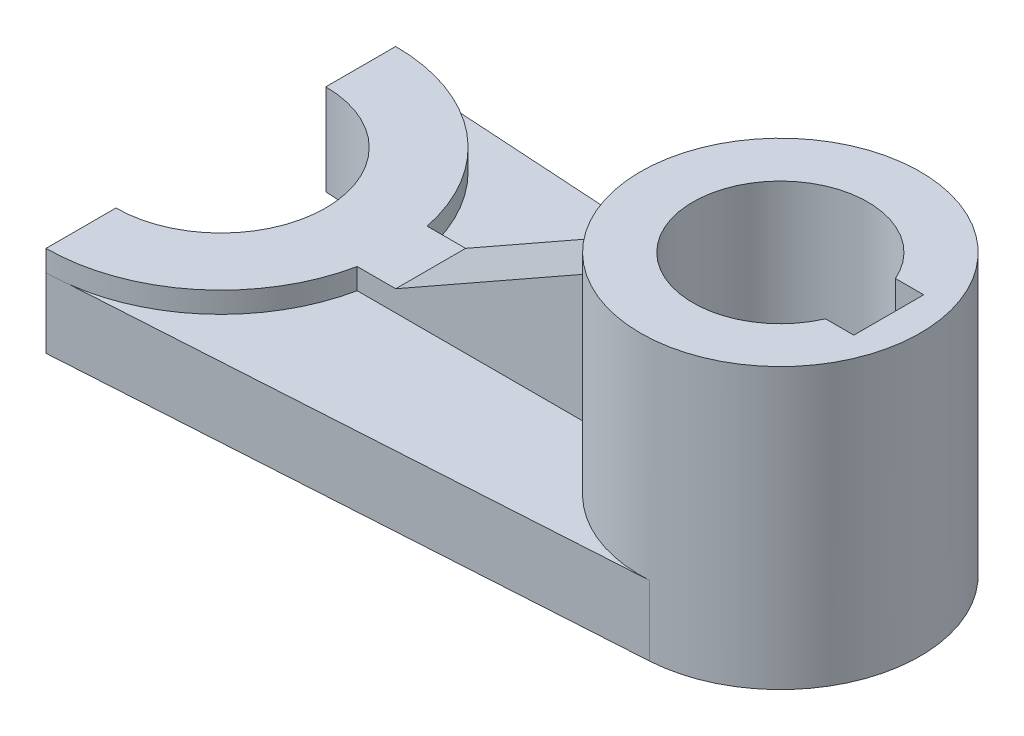
ISO-10303-21;
HEADER;
FILE_DESCRIPTION(('STEP AP214'),'2;1');
FILE_NAME('part.step','',(''),(''),'','','');
FILE_SCHEMA(('AUTOMOTIVE_DESIGN { 1 0 10303 214 1 1 1 1 }'));
ENDSEC;
DATA;
#1=APPLICATION_CONTEXT('core data for automotive mechanical design processes');
#2=APPLICATION_PROTOCOL_DEFINITION('international standard','automotive_design',2000,#1);
#3=PRODUCT_CONTEXT('',#1,'mechanical');
#4=PRODUCT('Part','Part','',(#3));
#5=PRODUCT_RELATED_PRODUCT_CATEGORY('part','',(#4));
#6=PRODUCT_DEFINITION_FORMATION('','',#4);
#7=PRODUCT_DEFINITION_CONTEXT('part definition',#1,'design');
#8=PRODUCT_DEFINITION('design','',#6,#7);
#9=PRODUCT_DEFINITION_SHAPE('','',#8);
#10=(LENGTH_UNIT() NAMED_UNIT(*) SI_UNIT(.MILLI.,.METRE.));
#11=(NAMED_UNIT(*) PLANE_ANGLE_UNIT() SI_UNIT($,.RADIAN.));
#12=(NAMED_UNIT(*) SI_UNIT($,.STERADIAN.) SOLID_ANGLE_UNIT());
#13=UNCERTAINTY_MEASURE_WITH_UNIT(LENGTH_MEASURE(1.E-05),#10,'distance_accuracy_value','');
#14=(GEOMETRIC_REPRESENTATION_CONTEXT(3) GLOBAL_UNCERTAINTY_ASSIGNED_CONTEXT((#13)) GLOBAL_UNIT_ASSIGNED_CONTEXT((#10,
#11,#12)) REPRESENTATION_CONTEXT('',''));
#15=CARTESIAN_POINT('',(0.,0.,0.));
#16=DIRECTION('',(0.,0.,1.));
#17=DIRECTION('',(1.,0.,0.));
#18=AXIS2_PLACEMENT_3D('',#15,#16,#17);
#19=CARTESIAN_POINT('',(-1.23801444701057,10.,0.));
#20=DIRECTION('',(0.,-1.,0.));
#21=DIRECTION('',(0.,0.,-1.));
#22=AXIS2_PLACEMENT_3D('',#19,#20,#21);
#23=PLANE('',#22);
#24=DIRECTION('',(-1.,0.,0.));
#25=VECTOR('',#24,1.);
#26=CARTESIAN_POINT('',(-1.23801444701057,10.,-5.));
#27=LINE('',#26,#25);
#28=CARTESIAN_POINT('',(-20.6029311780477,10.,-5.));
#29=VERTEX_POINT('',#28);
#30=CARTESIAN_POINT('',(-56.7431170191788,10.,-5.));
#31=VERTEX_POINT('',#30);
#32=EDGE_CURVE('E201',#29,#31,#27,.T.);
#33=ORIENTED_EDGE('',*,*,#32,.F.);
#34=CARTESIAN_POINT('',(-1.23801444701057,10.,0.));
#35=DIRECTION('',(0.,-1.,0.));
#36=DIRECTION('',(0.,0.,-1.));
#37=AXIS2_PLACEMENT_3D('',#34,#35,#36);
#38=CIRCLE('',#37,20.);
#39=CARTESIAN_POINT('',(0.,10.,-19.9616462304338));
#40=VERTEX_POINT('',#39);
#41=EDGE_CURVE('E276',#40,#29,#38,.F.);
#42=ORIENTED_EDGE('',*,*,#41,.F.);
#43=DIRECTION('',(0.998082311521691,0.,0.0619007223505285));
#44=VECTOR('',#43,1.);
#45=CARTESIAN_POINT('',(-81.2380144470106,10.,-25.));
#46=LINE('',#45,#44);
#47=CARTESIAN_POINT('',(-78.1489136445866,10.,-24.8084150286241));
#48=VERTEX_POINT('',#47);
#49=EDGE_CURVE('E247',#48,#40,#46,.T.);
#50=ORIENTED_EDGE('',*,*,#49,.F.);
#51=CARTESIAN_POINT('',(-81.2380144470106,10.,0.));
#52=DIRECTION('',(0.,-1.,0.));
#53=DIRECTION('',(0.,0.,-1.));
#54=AXIS2_PLACEMENT_3D('',#51,#52,#53);
#55=CIRCLE('',#54,25.);
#56=EDGE_CURVE('E237',#48,#31,#55,.T.);
#57=ORIENTED_EDGE('',*,*,#56,.T.);
#58=EDGE_LOOP('',(#33,#42,#50,#57));
#59=FACE_BOUND('',#58,.T.);
#60=ADVANCED_FACE('F33',(#59),#23,.F.);
#61=CARTESIAN_POINT('',(-81.2380144470106,13.,0.));
#62=DIRECTION('',(0.,-1.,0.));
#63=DIRECTION('',(0.,0.,-1.));
#64=AXIS2_PLACEMENT_3D('',#61,#62,#63);
#65=CYLINDRICAL_SURFACE('',#64,25.);
#66=CARTESIAN_POINT('',(-81.2380144470106,13.,0.));
#67=DIRECTION('',(0.,-1.,0.));
#68=DIRECTION('',(0.,0.,-1.));
#69=AXIS2_PLACEMENT_3D('',#66,#67,#68);
#70=CIRCLE('',#69,25.);
#71=CARTESIAN_POINT('',(-81.2380144470106,13.,-25.));
#72=VERTEX_POINT('',#71);
#73=CARTESIAN_POINT('',(-56.7431170191788,13.,-5.));
#74=VERTEX_POINT('',#73);
#75=EDGE_CURVE('E225',#72,#74,#70,.T.);
#76=ORIENTED_EDGE('',*,*,#75,.T.);
#77=DIRECTION('',(0.,-1.,0.));
#78=VECTOR('',#77,1.);
#79=CARTESIAN_POINT('',(-56.7431170191788,13.,-5.));
#80=LINE('',#79,#78);
#81=EDGE_CURVE('E199',#74,#31,#80,.T.);
#82=ORIENTED_EDGE('',*,*,#81,.T.);
#83=ORIENTED_EDGE('',*,*,#56,.F.);
#84=CARTESIAN_POINT('',(-81.2380144470106,10.,-25.));
#85=VERTEX_POINT('',#84);
#86=EDGE_CURVE('E233',#85,#48,#55,.T.);
#87=ORIENTED_EDGE('',*,*,#86,.F.);
#88=DIRECTION('',(0.,-1.,0.));
#89=VECTOR('',#88,1.);
#90=CARTESIAN_POINT('',(-81.2380144470106,13.,-25.));
#91=LINE('',#90,#89);
#92=EDGE_CURVE('E238',#72,#85,#91,.T.);
#93=ORIENTED_EDGE('',*,*,#92,.F.);
#94=EDGE_LOOP('',(#76,#82,#83,#87,#93));
#95=FACE_BOUND('',#94,.T.);
#96=ADVANCED_FACE('F297',(#95),#65,.T.);
#97=CARTESIAN_POINT('',(-81.2380144470106,10.,-25.));
#98=DIRECTION('',(1.,0.,0.));
#99=DIRECTION('',(0.,0.,-1.));
#100=AXIS2_PLACEMENT_3D('',#97,#98,#99);
#101=PLANE('',#100);
#102=DIRECTION('',(0.,0.,1.));
#103=VECTOR('',#102,1.);
#104=CARTESIAN_POINT('',(-81.2380144470106,13.,-25.));
#105=LINE('',#104,#103);
#106=CARTESIAN_POINT('',(-81.2380144470106,13.,15.));
#107=VERTEX_POINT('',#106);
#108=CARTESIAN_POINT('',(-81.2380144470106,13.,25.));
#109=VERTEX_POINT('',#108);
#110=EDGE_CURVE('E227',#107,#109,#105,.T.);
#111=ORIENTED_EDGE('',*,*,#110,.F.);
#112=DIRECTION('',(0.,-1.,0.));
#113=VECTOR('',#112,1.);
#114=CARTESIAN_POINT('',(-81.2380144470106,169.945815502807,15.));
#115=LINE('',#114,#113);
#116=CARTESIAN_POINT('',(-81.2380144470106,0.,15.));
#117=VERTEX_POINT('',#116);
#118=EDGE_CURVE('E218',#107,#117,#115,.T.);
#119=ORIENTED_EDGE('',*,*,#118,.T.);
#120=DIRECTION('',(0.,0.,1.));
#121=VECTOR('',#120,1.);
#122=CARTESIAN_POINT('',(-81.2380144470106,0.,-25.));
#123=LINE('',#122,#121);
#124=CARTESIAN_POINT('',(-81.2380144470106,0.,25.));
#125=VERTEX_POINT('',#124);
#126=EDGE_CURVE('E241',#117,#125,#123,.T.);
#127=ORIENTED_EDGE('',*,*,#126,.T.);
#128=DIRECTION('',(0.,-1.,0.));
#129=VECTOR('',#128,1.);
#130=CARTESIAN_POINT('',(-81.2380144470106,10.,25.));
#131=LINE('',#130,#129);
#132=CARTESIAN_POINT('',(-81.2380144470106,10.,25.));
#133=VERTEX_POINT('',#132);
#134=EDGE_CURVE('E270',#133,#125,#131,.T.);
#135=ORIENTED_EDGE('',*,*,#134,.F.);
#136=DIRECTION('',(0.,-1.,0.));
#137=VECTOR('',#136,1.);
#138=CARTESIAN_POINT('',(-81.2380144470106,13.,25.));
#139=LINE('',#138,#137);
#140=EDGE_CURVE('E232',#109,#133,#139,.T.);
#141=ORIENTED_EDGE('',*,*,#140,.F.);
#142=EDGE_LOOP('',(#111,#119,#127,#135,#141));
#143=FACE_BOUND('',#142,.T.);
#144=ADVANCED_FACE('F304',(#143),#101,.F.);
#145=CARTESIAN_POINT('',(-81.2380144470106,0.,-25.));
#146=VERTEX_POINT('',#145);
#147=CARTESIAN_POINT('',(-81.2380144470106,0.,-15.));
#148=VERTEX_POINT('',#147);
#149=EDGE_CURVE('E253',#146,#148,#123,.T.);
#150=ORIENTED_EDGE('',*,*,#149,.T.);
#151=DIRECTION('',(0.,-1.,0.));
#152=VECTOR('',#151,1.);
#153=CARTESIAN_POINT('',(-81.2380144470106,169.945815502807,-15.));
#154=LINE('',#153,#152);
#155=CARTESIAN_POINT('',(-81.2380144470106,13.,-15.));
#156=VERTEX_POINT('',#155);
#157=EDGE_CURVE('E217',#156,#148,#154,.T.);
#158=ORIENTED_EDGE('',*,*,#157,.F.);
#159=EDGE_CURVE('E229',#72,#156,#105,.T.);
#160=ORIENTED_EDGE('',*,*,#159,.F.);
#161=ORIENTED_EDGE('',*,*,#92,.T.);
#162=DIRECTION('',(0.,-1.,0.));
#163=VECTOR('',#162,1.);
#164=CARTESIAN_POINT('',(-81.2380144470106,10.,-25.));
#165=LINE('',#164,#163);
#166=EDGE_CURVE('E252',#85,#146,#165,.T.);
#167=ORIENTED_EDGE('',*,*,#166,.T.);
#168=EDGE_LOOP('',(#150,#158,#160,#161,#167));
#169=FACE_BOUND('',#168,.T.);
#170=ADVANCED_FACE('F35',(#169),#101,.F.);
#171=CARTESIAN_POINT('',(-81.2380144470106,10.,25.));
#172=DIRECTION('',(-0.0619007223505286,0.,-0.998082311521691));
#173=DIRECTION('',(-0.998082311521692,0.,0.0619007223505286));
#174=AXIS2_PLACEMENT_3D('',#171,#172,#173);
#175=PLANE('',#174);
#176=DIRECTION('',(0.998082311521691,0.,-0.0619007223505285));
#177=VECTOR('',#176,1.);
#178=CARTESIAN_POINT('',(-81.2380144470106,0.,25.));
#179=LINE('',#178,#177);
#180=CARTESIAN_POINT('',(0.,0.,19.9616462304338));
#181=VERTEX_POINT('',#180);
#182=EDGE_CURVE('E256',#125,#181,#179,.T.);
#183=ORIENTED_EDGE('',*,*,#182,.T.);
#184=DIRECTION('',(0.,-1.,0.));
#185=VECTOR('',#184,1.);
#186=CARTESIAN_POINT('',(0.,10.,19.9616462304338));
#187=LINE('',#186,#185);
#188=CARTESIAN_POINT('',(0.,10.,19.9616462304338));
#189=VERTEX_POINT('',#188);
#190=EDGE_CURVE('E267',#189,#181,#187,.T.);
#191=ORIENTED_EDGE('',*,*,#190,.F.);
#192=DIRECTION('',(0.998082311521691,0.,-0.0619007223505285));
#193=VECTOR('',#192,1.);
#194=CARTESIAN_POINT('',(-81.2380144470106,10.,25.));
#195=LINE('',#194,#193);
#196=CARTESIAN_POINT('',(-78.1489136445866,10.,24.8084150286241));
#197=VERTEX_POINT('',#196);
#198=EDGE_CURVE('E248',#197,#189,#195,.T.);
#199=ORIENTED_EDGE('',*,*,#198,.F.);
#200=EDGE_CURVE('E244',#133,#197,#195,.T.);
#201=ORIENTED_EDGE('',*,*,#200,.F.);
#202=ORIENTED_EDGE('',*,*,#134,.T.);
#203=EDGE_LOOP('',(#183,#191,#199,#201,#202));
#204=FACE_BOUND('',#203,.T.);
#205=ADVANCED_FACE('F342',(#204),#175,.F.);
#206=CARTESIAN_POINT('',(-1.23801444701057,10.,0.));
#207=DIRECTION('',(0.,-1.,0.));
#208=DIRECTION('',(0.,0.,-1.));
#209=AXIS2_PLACEMENT_3D('',#206,#207,#208);
#210=CYLINDRICAL_SURFACE('',#209,20.);
#211=ORIENTED_EDGE('',*,*,#190,.T.);
#212=CARTESIAN_POINT('',(-1.23801444701057,0.,0.));
#213=DIRECTION('',(0.,-1.,0.));
#214=DIRECTION('',(0.,0.,-1.));
#215=AXIS2_PLACEMENT_3D('',#212,#213,#214);
#216=CIRCLE('',#215,20.);
#217=CARTESIAN_POINT('',(0.,0.,-19.9616462304338));
#218=VERTEX_POINT('',#217);
#219=EDGE_CURVE('E259',#218,#181,#216,.T.);
#220=ORIENTED_EDGE('',*,*,#219,.F.);
#221=DIRECTION('',(0.,-1.,0.));
#222=VECTOR('',#221,1.);
#223=CARTESIAN_POINT('',(0.,10.,-19.9616462304338));
#224=LINE('',#223,#222);
#225=EDGE_CURVE('E265',#40,#218,#224,.T.);
#226=ORIENTED_EDGE('',*,*,#225,.F.);
#227=ORIENTED_EDGE('',*,*,#41,.T.);
#228=DIRECTION('',(0.,-1.,0.));
#229=VECTOR('',#228,1.);
#230=CARTESIAN_POINT('',(-20.6029311780477,10.,-5.));
#231=LINE('',#230,#229);
#232=CARTESIAN_POINT('',(-20.6029311780477,30.359880519079,-5.));
#233=VERTEX_POINT('',#232);
#234=EDGE_CURVE('E204',#29,#233,#231,.F.);
#235=ORIENTED_EDGE('',*,*,#234,.T.);
#236=CARTESIAN_POINT('',(-1.23801444701057,41.3333333333333,0.));
#237=DIRECTION('',(0.49301257198088,-0.870022185848612,0.));
#238=DIRECTION('',(-0.870022185848612,-0.49301257198088,0.));
#239=AXIS2_PLACEMENT_3D('',#236,#237,#238);
#240=ELLIPSE('',#239,22.9879195327556,20.);
#241=CARTESIAN_POINT('',(-20.6029311780477,30.359880519079,5.));
#242=VERTEX_POINT('',#241);
#243=EDGE_CURVE('E56',#242,#233,#240,.T.);
#244=ORIENTED_EDGE('',*,*,#243,.F.);
#245=DIRECTION('',(0.,-1.,0.));
#246=VECTOR('',#245,1.);
#247=CARTESIAN_POINT('',(-20.6029311780477,10.,5.));
#248=LINE('',#247,#246);
#249=CARTESIAN_POINT('',(-20.6029311780477,10.,5.));
#250=VERTEX_POINT('',#249);
#251=EDGE_CURVE('E211',#250,#242,#248,.F.);
#252=ORIENTED_EDGE('',*,*,#251,.F.);
#253=EDGE_CURVE('E275',#250,#189,#38,.F.);
#254=ORIENTED_EDGE('',*,*,#253,.T.);
#255=EDGE_LOOP('',(#211,#220,#226,#227,#235,#244,#252,#254));
#256=FACE_BOUND('',#255,.T.);
#257=CARTESIAN_POINT('',(-1.23801444701057,40.,0.));
#258=DIRECTION('',(0.,1.,0.));
#259=DIRECTION('',(0.,0.,1.));
#260=AXIS2_PLACEMENT_3D('',#257,#258,#259);
#261=CIRCLE('',#260,20.);
#262=CARTESIAN_POINT('',(-1.23801444701057,40.,20.));
#263=VERTEX_POINT('',#262);
#264=EDGE_CURVE('E214',#263,#263,#261,.T.);
#265=ORIENTED_EDGE('',*,*,#264,.F.);
#266=EDGE_LOOP('',(#265));
#267=FACE_BOUND('',#266,.T.);
#268=ADVANCED_FACE('F317',(#256,#267),#210,.T.);
#269=CARTESIAN_POINT('',(-81.2380144470106,10.,-25.));
#270=DIRECTION('',(0.0619007223505286,0.,-0.998082311521691));
#271=DIRECTION('',(-0.998082311521692,0.,-0.0619007223505286));
#272=AXIS2_PLACEMENT_3D('',#269,#270,#271);
#273=PLANE('',#272);
#274=DIRECTION('',(0.998082311521691,0.,0.0619007223505285));
#275=VECTOR('',#274,1.);
#276=CARTESIAN_POINT('',(-81.2380144470106,0.,-25.));
#277=LINE('',#276,#275);
#278=EDGE_CURVE('E261',#146,#218,#277,.T.);
#279=ORIENTED_EDGE('',*,*,#278,.F.);
#280=ORIENTED_EDGE('',*,*,#166,.F.);
#281=EDGE_CURVE('E249',#85,#48,#46,.T.);
#282=ORIENTED_EDGE('',*,*,#281,.T.);
#283=ORIENTED_EDGE('',*,*,#49,.T.);
#284=ORIENTED_EDGE('',*,*,#225,.T.);
#285=EDGE_LOOP('',(#279,#280,#282,#283,#284));
#286=FACE_BOUND('',#285,.T.);
#287=ADVANCED_FACE('F310',(#286),#273,.T.);
#288=ORIENTED_EDGE('',*,*,#253,.F.);
#289=DIRECTION('',(-1.,0.,0.));
#290=VECTOR('',#289,1.);
#291=CARTESIAN_POINT('',(-1.23801444701057,10.,5.));
#292=LINE('',#291,#290);
#293=CARTESIAN_POINT('',(-56.7431170191788,10.,5.));
#294=VERTEX_POINT('',#293);
#295=EDGE_CURVE('E209',#250,#294,#292,.T.);
#296=ORIENTED_EDGE('',*,*,#295,.T.);
#297=EDGE_CURVE('E236',#294,#197,#55,.T.);
#298=ORIENTED_EDGE('',*,*,#297,.T.);
#299=ORIENTED_EDGE('',*,*,#198,.T.);
#300=EDGE_LOOP('',(#288,#296,#298,#299));
#301=FACE_BOUND('',#300,.T.);
#302=ADVANCED_FACE('F300',(#301),#23,.F.);
#303=CARTESIAN_POINT('',(-1.23801444701057,0.,0.));
#304=DIRECTION('',(0.,-1.,0.));
#305=DIRECTION('',(0.,0.,-1.));
#306=AXIS2_PLACEMENT_3D('',#303,#304,#305);
#307=PLANE('',#306);
#308=DIRECTION('',(1.,0.,0.));
#309=VECTOR('',#308,1.);
#310=CARTESIAN_POINT('',(-1.23801444701056,0.,5.00000000000001));
#311=LINE('',#310,#309);
#312=CARTESIAN_POINT('',(10.218424790379,0.,5.00000000000001));
#313=VERTEX_POINT('',#312);
#314=CARTESIAN_POINT('',(14.2619855529894,0.,5.));
#315=VERTEX_POINT('',#314);
#316=EDGE_CURVE('E162',#313,#315,#311,.T.);
#317=ORIENTED_EDGE('',*,*,#316,.T.);
#318=DIRECTION('',(0.,0.,-1.));
#319=VECTOR('',#318,1.);
#320=CARTESIAN_POINT('',(14.2619855529894,0.,5.));
#321=LINE('',#320,#319);
#322=CARTESIAN_POINT('',(14.2619855529894,0.,-5.));
#323=VERTEX_POINT('',#322);
#324=EDGE_CURVE('E157',#315,#323,#321,.T.);
#325=ORIENTED_EDGE('',*,*,#324,.T.);
#326=DIRECTION('',(-1.,0.,0.));
#327=VECTOR('',#326,1.);
#328=CARTESIAN_POINT('',(14.2619855529894,0.,-5.));
#329=LINE('',#328,#327);
#330=CARTESIAN_POINT('',(10.218424790379,0.,-4.99999999999999));
#331=VERTEX_POINT('',#330);
#332=EDGE_CURVE('E165',#323,#331,#329,.T.);
#333=ORIENTED_EDGE('',*,*,#332,.T.);
#334=CARTESIAN_POINT('',(-1.23801444701057,0.,0.));
#335=DIRECTION('',(0.,1.,0.));
#336=DIRECTION('',(0.,0.,1.));
#337=AXIS2_PLACEMENT_3D('',#334,#335,#336);
#338=CIRCLE('',#337,12.5);
#339=EDGE_CURVE('E182',#331,#313,#338,.T.);
#340=ORIENTED_EDGE('',*,*,#339,.T.);
#341=EDGE_LOOP('',(#317,#325,#333,#340));
#342=FACE_BOUND('',#341,.T.);
#343=ORIENTED_EDGE('',*,*,#126,.F.);
#344=CARTESIAN_POINT('',(-81.2380144470106,0.,0.));
#345=DIRECTION('',(0.,-1.,0.));
#346=DIRECTION('',(0.,0.,-1.));
#347=AXIS2_PLACEMENT_3D('',#344,#345,#346);
#348=CIRCLE('',#347,15.);
#349=EDGE_CURVE('E221',#148,#117,#348,.T.);
#350=ORIENTED_EDGE('',*,*,#349,.F.);
#351=ORIENTED_EDGE('',*,*,#149,.F.);
#352=ORIENTED_EDGE('',*,*,#278,.T.);
#353=ORIENTED_EDGE('',*,*,#219,.T.);
#354=ORIENTED_EDGE('',*,*,#182,.F.);
#355=EDGE_LOOP('',(#343,#350,#351,#352,#353,#354));
#356=FACE_BOUND('',#355,.T.);
#357=ADVANCED_FACE('F171',(#342,#356),#307,.T.);
#358=CARTESIAN_POINT('',(-81.2380144470106,10.,0.));
#359=DIRECTION('',(0.,-1.,0.));
#360=DIRECTION('',(0.,0.,-1.));
#361=AXIS2_PLACEMENT_3D('',#358,#359,#360);
#362=PLANE('',#361);
#363=EDGE_CURVE('E224',#197,#133,#55,.T.);
#364=ORIENTED_EDGE('',*,*,#363,.T.);
#365=ORIENTED_EDGE('',*,*,#200,.T.);
#366=EDGE_LOOP('',(#364,#365));
#367=FACE_BOUND('',#366,.T.);
#368=ADVANCED_FACE('F316',(#367),#362,.T.);
#369=DIRECTION('',(0.,-1.,0.));
#370=VECTOR('',#369,1.);
#371=CARTESIAN_POINT('',(-56.7431170191788,13.,5.));
#372=LINE('',#371,#370);
#373=CARTESIAN_POINT('',(-56.7431170191788,13.,5.));
#374=VERTEX_POINT('',#373);
#375=EDGE_CURVE('E206',#374,#294,#372,.T.);
#376=ORIENTED_EDGE('',*,*,#375,.F.);
#377=EDGE_CURVE('E228',#374,#109,#70,.T.);
#378=ORIENTED_EDGE('',*,*,#377,.T.);
#379=ORIENTED_EDGE('',*,*,#140,.T.);
#380=ORIENTED_EDGE('',*,*,#363,.F.);
#381=ORIENTED_EDGE('',*,*,#297,.F.);
#382=EDGE_LOOP('',(#376,#378,#379,#380,#381));
#383=FACE_BOUND('',#382,.T.);
#384=ADVANCED_FACE('F307',(#383),#65,.T.);
#385=CARTESIAN_POINT('',(-81.2380144470106,13.,0.));
#386=DIRECTION('',(0.,-1.,0.));
#387=DIRECTION('',(0.,0.,-1.));
#388=AXIS2_PLACEMENT_3D('',#385,#386,#387);
#389=PLANE('',#388);
#390=ORIENTED_EDGE('',*,*,#377,.F.);
#391=DIRECTION('',(1.,0.,0.));
#392=VECTOR('',#391,1.);
#393=CARTESIAN_POINT('',(-31.2380144470106,13.,5.));
#394=LINE('',#393,#392);
#395=CARTESIAN_POINT('',(-51.2380144470105,13.,5.));
#396=VERTEX_POINT('',#395);
#397=EDGE_CURVE('E187',#374,#396,#394,.T.);
#398=ORIENTED_EDGE('',*,*,#397,.T.);
#399=DIRECTION('',(0.,0.,1.));
#400=VECTOR('',#399,1.);
#401=CARTESIAN_POINT('',(-51.2380144470105,13.,0.));
#402=LINE('',#401,#400);
#403=CARTESIAN_POINT('',(-51.2380144470105,13.,-5.));
#404=VERTEX_POINT('',#403);
#405=EDGE_CURVE('E189',#404,#396,#402,.T.);
#406=ORIENTED_EDGE('',*,*,#405,.F.);
#407=DIRECTION('',(1.,0.,0.));
#408=VECTOR('',#407,1.);
#409=CARTESIAN_POINT('',(-31.2380144470106,13.,-5.));
#410=LINE('',#409,#408);
#411=EDGE_CURVE('E193',#74,#404,#410,.T.);
#412=ORIENTED_EDGE('',*,*,#411,.F.);
#413=ORIENTED_EDGE('',*,*,#75,.F.);
#414=ORIENTED_EDGE('',*,*,#159,.T.);
#415=CARTESIAN_POINT('',(-81.2380144470106,13.,0.));
#416=DIRECTION('',(0.,-1.,0.));
#417=DIRECTION('',(0.,0.,-1.));
#418=AXIS2_PLACEMENT_3D('',#415,#416,#417);
#419=CIRCLE('',#418,15.);
#420=EDGE_CURVE('E273',#156,#107,#419,.T.);
#421=ORIENTED_EDGE('',*,*,#420,.T.);
#422=ORIENTED_EDGE('',*,*,#110,.T.);
#423=EDGE_LOOP('',(#390,#398,#406,#412,#413,#414,#421,#422));
#424=FACE_BOUND('',#423,.T.);
#425=ADVANCED_FACE('F364',(#424),#389,.F.);
#426=ORIENTED_EDGE('',*,*,#281,.F.);
#427=ORIENTED_EDGE('',*,*,#86,.T.);
#428=EDGE_LOOP('',(#426,#427));
#429=FACE_BOUND('',#428,.T.);
#430=ADVANCED_FACE('F373',(#429),#362,.T.);
#431=CARTESIAN_POINT('',(-81.2380144470106,169.945815502807,0.));
#432=DIRECTION('',(0.,-1.,0.));
#433=DIRECTION('',(0.,0.,-1.));
#434=AXIS2_PLACEMENT_3D('',#431,#432,#433);
#435=CYLINDRICAL_SURFACE('',#434,15.);
#436=ORIENTED_EDGE('',*,*,#118,.F.);
#437=ORIENTED_EDGE('',*,*,#420,.F.);
#438=ORIENTED_EDGE('',*,*,#157,.T.);
#439=ORIENTED_EDGE('',*,*,#349,.T.);
#440=EDGE_LOOP('',(#436,#437,#438,#439));
#441=FACE_BOUND('',#440,.T.);
#442=ADVANCED_FACE('F369',(#441),#435,.F.);
#443=CARTESIAN_POINT('',(-1.23801444701057,40.,0.));
#444=DIRECTION('',(0.,1.,0.));
#445=DIRECTION('',(0.,0.,1.));
#446=AXIS2_PLACEMENT_3D('',#443,#444,#445);
#447=PLANE('',#446);
#448=DIRECTION('',(1.,0.,0.));
#449=VECTOR('',#448,1.);
#450=CARTESIAN_POINT('',(-1.23801444701056,40.,5.00000000000001));
#451=LINE('',#450,#449);
#452=CARTESIAN_POINT('',(10.218424790379,40.,5.00000000000001));
#453=VERTEX_POINT('',#452);
#454=CARTESIAN_POINT('',(14.2619855529894,40.,5.));
#455=VERTEX_POINT('',#454);
#456=EDGE_CURVE('E173',#453,#455,#451,.T.);
#457=ORIENTED_EDGE('',*,*,#456,.F.);
#458=CARTESIAN_POINT('',(-1.23801444701057,40.,0.));
#459=DIRECTION('',(0.,1.,0.));
#460=DIRECTION('',(0.,0.,1.));
#461=AXIS2_PLACEMENT_3D('',#458,#459,#460);
#462=CIRCLE('',#461,12.5);
#463=CARTESIAN_POINT('',(10.218424790379,40.,-4.99999999999999));
#464=VERTEX_POINT('',#463);
#465=EDGE_CURVE('E180',#464,#453,#462,.T.);
#466=ORIENTED_EDGE('',*,*,#465,.F.);
#467=DIRECTION('',(-1.,0.,0.));
#468=VECTOR('',#467,1.);
#469=CARTESIAN_POINT('',(14.2619855529894,40.,-5.));
#470=LINE('',#469,#468);
#471=CARTESIAN_POINT('',(14.2619855529894,40.,-5.));
#472=VERTEX_POINT('',#471);
#473=EDGE_CURVE('E48',#472,#464,#470,.T.);
#474=ORIENTED_EDGE('',*,*,#473,.F.);
#475=DIRECTION('',(0.,0.,-1.));
#476=VECTOR('',#475,1.);
#477=CARTESIAN_POINT('',(14.2619855529894,40.,5.));
#478=LINE('',#477,#476);
#479=EDGE_CURVE('E160',#455,#472,#478,.T.);
#480=ORIENTED_EDGE('',*,*,#479,.F.);
#481=EDGE_LOOP('',(#457,#466,#474,#480));
#482=FACE_BOUND('',#481,.T.);
#483=ORIENTED_EDGE('',*,*,#264,.T.);
#484=EDGE_LOOP('',(#483));
#485=FACE_BOUND('',#484,.T.);
#486=ADVANCED_FACE('F283',(#482,#485),#447,.T.);
#487=CARTESIAN_POINT('',(-51.2380144470105,13.,0.));
#488=DIRECTION('',(0.49301257198088,-0.870022185848612,0.));
#489=DIRECTION('',(0.870022185848612,0.49301257198088,0.));
#490=AXIS2_PLACEMENT_3D('',#487,#488,#489);
#491=PLANE('',#490);
#492=DIRECTION('',(0.870022185848612,0.49301257198088,0.));
#493=VECTOR('',#492,1.);
#494=CARTESIAN_POINT('',(-51.2380144470105,13.,5.));
#495=LINE('',#494,#493);
#496=EDGE_CURVE('E190',#396,#242,#495,.T.);
#497=ORIENTED_EDGE('',*,*,#496,.T.);
#498=ORIENTED_EDGE('',*,*,#243,.T.);
#499=DIRECTION('',(0.870022185848612,0.49301257198088,0.));
#500=VECTOR('',#499,1.);
#501=CARTESIAN_POINT('',(-51.2380144470105,13.,-5.));
#502=LINE('',#501,#500);
#503=EDGE_CURVE('E184',#404,#233,#502,.T.);
#504=ORIENTED_EDGE('',*,*,#503,.F.);
#505=ORIENTED_EDGE('',*,*,#405,.T.);
#506=EDGE_LOOP('',(#497,#498,#504,#505));
#507=FACE_BOUND('',#506,.T.);
#508=ADVANCED_FACE('F362',(#507),#491,.F.);
#509=CARTESIAN_POINT('',(-31.2380144470106,20.,5.));
#510=DIRECTION('',(0.,0.,1.));
#511=DIRECTION('',(1.,0.,0.));
#512=AXIS2_PLACEMENT_3D('',#509,#510,#511);
#513=PLANE('',#512);
#514=ORIENTED_EDGE('',*,*,#295,.F.);
#515=ORIENTED_EDGE('',*,*,#251,.T.);
#516=ORIENTED_EDGE('',*,*,#496,.F.);
#517=ORIENTED_EDGE('',*,*,#397,.F.);
#518=ORIENTED_EDGE('',*,*,#375,.T.);
#519=EDGE_LOOP('',(#514,#515,#516,#517,#518));
#520=FACE_BOUND('',#519,.T.);
#521=ADVANCED_FACE('F327',(#520),#513,.T.);
#522=CARTESIAN_POINT('',(-31.2380144470106,20.,-5.));
#523=DIRECTION('',(0.,0.,1.));
#524=DIRECTION('',(1.,0.,0.));
#525=AXIS2_PLACEMENT_3D('',#522,#523,#524);
#526=PLANE('',#525);
#527=ORIENTED_EDGE('',*,*,#234,.F.);
#528=ORIENTED_EDGE('',*,*,#32,.T.);
#529=ORIENTED_EDGE('',*,*,#81,.F.);
#530=ORIENTED_EDGE('',*,*,#411,.T.);
#531=ORIENTED_EDGE('',*,*,#503,.T.);
#532=EDGE_LOOP('',(#527,#528,#529,#530,#531));
#533=FACE_BOUND('',#532,.T.);
#534=ADVANCED_FACE('F294',(#533),#526,.F.);
#535=CARTESIAN_POINT('',(-1.23801444701057,0.,0.));
#536=DIRECTION('',(0.,1.,0.));
#537=DIRECTION('',(0.,0.,1.));
#538=AXIS2_PLACEMENT_3D('',#535,#536,#537);
#539=CYLINDRICAL_SURFACE('',#538,12.5);
#540=ORIENTED_EDGE('',*,*,#465,.T.);
#541=DIRECTION('',(0.,1.,0.));
#542=VECTOR('',#541,1.);
#543=CARTESIAN_POINT('',(10.218424790379,0.,5.00000000000001));
#544=LINE('',#543,#542);
#545=EDGE_CURVE('E11',#453,#313,#544,.F.);
#546=ORIENTED_EDGE('',*,*,#545,.T.);
#547=ORIENTED_EDGE('',*,*,#339,.F.);
#548=DIRECTION('',(0.,1.,0.));
#549=VECTOR('',#548,1.);
#550=CARTESIAN_POINT('',(10.218424790379,0.,-4.99999999999999));
#551=LINE('',#550,#549);
#552=EDGE_CURVE('E41',#331,#464,#551,.T.);
#553=ORIENTED_EDGE('',*,*,#552,.T.);
#554=EDGE_LOOP('',(#540,#546,#547,#553));
#555=FACE_BOUND('',#554,.T.);
#556=ADVANCED_FACE('F280',(#555),#539,.F.);
#557=CARTESIAN_POINT('',(-1.23801444701056,0.,5.00000000000001));
#558=DIRECTION('',(0.,0.,1.));
#559=DIRECTION('',(1.,0.,0.));
#560=AXIS2_PLACEMENT_3D('',#557,#558,#559);
#561=PLANE('',#560);
#562=ORIENTED_EDGE('',*,*,#456,.T.);
#563=DIRECTION('',(0.,1.,0.));
#564=VECTOR('',#563,1.);
#565=CARTESIAN_POINT('',(14.2619855529894,0.,5.));
#566=LINE('',#565,#564);
#567=EDGE_CURVE('E161',#315,#455,#566,.T.);
#568=ORIENTED_EDGE('',*,*,#567,.F.);
#569=ORIENTED_EDGE('',*,*,#316,.F.);
#570=ORIENTED_EDGE('',*,*,#545,.F.);
#571=EDGE_LOOP('',(#562,#568,#569,#570));
#572=FACE_BOUND('',#571,.T.);
#573=ADVANCED_FACE('F286',(#572),#561,.F.);
#574=CARTESIAN_POINT('',(14.2619855529894,0.,-5.));
#575=DIRECTION('',(0.,0.,-1.));
#576=DIRECTION('',(-1.,0.,0.));
#577=AXIS2_PLACEMENT_3D('',#574,#575,#576);
#578=PLANE('',#577);
#579=ORIENTED_EDGE('',*,*,#332,.F.);
#580=DIRECTION('',(0.,1.,0.));
#581=VECTOR('',#580,1.);
#582=CARTESIAN_POINT('',(14.2619855529894,0.,-5.));
#583=LINE('',#582,#581);
#584=EDGE_CURVE('E152',#323,#472,#583,.T.);
#585=ORIENTED_EDGE('',*,*,#584,.T.);
#586=ORIENTED_EDGE('',*,*,#473,.T.);
#587=ORIENTED_EDGE('',*,*,#552,.F.);
#588=EDGE_LOOP('',(#579,#585,#586,#587));
#589=FACE_BOUND('',#588,.T.);
#590=ADVANCED_FACE('F166',(#589),#578,.F.);
#591=CARTESIAN_POINT('',(14.2619855529894,0.,5.));
#592=DIRECTION('',(1.,0.,0.));
#593=DIRECTION('',(0.,0.,-1.));
#594=AXIS2_PLACEMENT_3D('',#591,#592,#593);
#595=PLANE('',#594);
#596=ORIENTED_EDGE('',*,*,#479,.T.);
#597=ORIENTED_EDGE('',*,*,#584,.F.);
#598=ORIENTED_EDGE('',*,*,#324,.F.);
#599=ORIENTED_EDGE('',*,*,#567,.T.);
#600=EDGE_LOOP('',(#596,#597,#598,#599));
#601=FACE_BOUND('',#600,.T.);
#602=ADVANCED_FACE('F154',(#601),#595,.F.);
#603=CLOSED_SHELL('',(#60,#96,#144,#170,#205,#268,#287,#302,#357,#368,#384,#425,#430,#442,#486,
#508,#521,#534,#556,#573,#590,#602));
#604=MANIFOLD_SOLID_BREP('B2',#603);
#605=ADVANCED_BREP_SHAPE_REPRESENTATION('',(#18,#604),#14);
#606=SHAPE_DEFINITION_REPRESENTATION(#9,#605);
ENDSEC;
END-ISO-10303-21;
